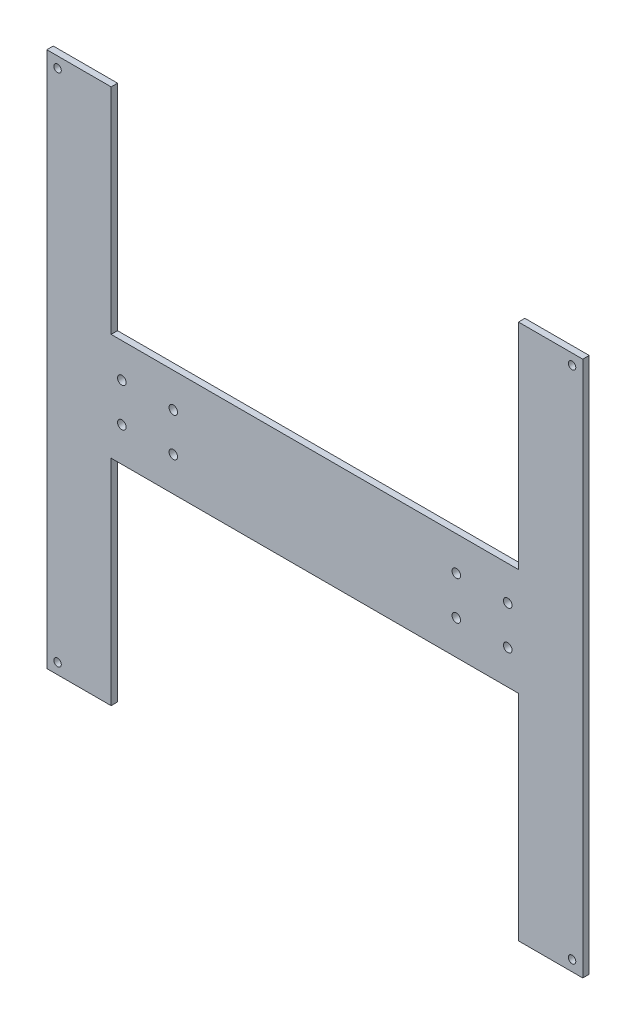
ISO-10303-21;
HEADER;
FILE_DESCRIPTION(('STEP AP214'),'2;1');
FILE_NAME('part.step','',(''),(''),'','','');
FILE_SCHEMA(('AUTOMOTIVE_DESIGN { 1 0 10303 214 1 1 1 1 }'));
ENDSEC;
DATA;
#1=APPLICATION_CONTEXT('core data for automotive mechanical design processes');
#2=APPLICATION_PROTOCOL_DEFINITION('international standard','automotive_design',2000,#1);
#3=PRODUCT_CONTEXT('',#1,'mechanical');
#4=PRODUCT('Part','Part','',(#3));
#5=PRODUCT_RELATED_PRODUCT_CATEGORY('part','',(#4));
#6=PRODUCT_DEFINITION_FORMATION('','',#4);
#7=PRODUCT_DEFINITION_CONTEXT('part definition',#1,'design');
#8=PRODUCT_DEFINITION('design','',#6,#7);
#9=PRODUCT_DEFINITION_SHAPE('','',#8);
#10=(LENGTH_UNIT() NAMED_UNIT(*) SI_UNIT(.MILLI.,.METRE.));
#11=(NAMED_UNIT(*) PLANE_ANGLE_UNIT() SI_UNIT($,.RADIAN.));
#12=(NAMED_UNIT(*) SI_UNIT($,.STERADIAN.) SOLID_ANGLE_UNIT());
#13=UNCERTAINTY_MEASURE_WITH_UNIT(LENGTH_MEASURE(1.E-05),#10,'distance_accuracy_value','');
#14=(GEOMETRIC_REPRESENTATION_CONTEXT(3) GLOBAL_UNCERTAINTY_ASSIGNED_CONTEXT((#13)) GLOBAL_UNIT_ASSIGNED_CONTEXT((#10,
#11,#12)) REPRESENTATION_CONTEXT('',''));
#15=CARTESIAN_POINT('',(0.,0.,0.));
#16=DIRECTION('',(0.,0.,1.));
#17=DIRECTION('',(1.,0.,0.));
#18=AXIS2_PLACEMENT_3D('',#15,#16,#17);
#19=CARTESIAN_POINT('',(0.,0.,3.));
#20=DIRECTION('',(0.,0.,-1.));
#21=DIRECTION('',(-1.,0.,0.));
#22=AXIS2_PLACEMENT_3D('',#19,#20,#21);
#23=PLANE('',#22);
#24=CARTESIAN_POINT('',(120.,-120.,3.));
#25=DIRECTION('',(0.,0.,1.));
#26=DIRECTION('',(1.,0.,0.));
#27=AXIS2_PLACEMENT_3D('',#24,#25,#26);
#28=CIRCLE('',#27,1.75);
#29=CARTESIAN_POINT('',(121.75,-120.,3.));
#30=VERTEX_POINT('',#29);
#31=EDGE_CURVE('E317',#30,#30,#28,.T.);
#32=ORIENTED_EDGE('',*,*,#31,.F.);
#33=EDGE_LOOP('',(#32));
#34=FACE_BOUND('',#33,.T.);
#35=CARTESIAN_POINT('',(-120.,-120.,3.));
#36=DIRECTION('',(0.,0.,1.));
#37=DIRECTION('',(1.,0.,0.));
#38=AXIS2_PLACEMENT_3D('',#35,#36,#37);
#39=CIRCLE('',#38,1.75);
#40=CARTESIAN_POINT('',(-118.25,-120.,3.));
#41=VERTEX_POINT('',#40);
#42=EDGE_CURVE('E319',#41,#41,#39,.T.);
#43=ORIENTED_EDGE('',*,*,#42,.F.);
#44=EDGE_LOOP('',(#43));
#45=FACE_BOUND('',#44,.T.);
#46=CARTESIAN_POINT('',(120.,120.,3.));
#47=DIRECTION('',(0.,0.,1.));
#48=DIRECTION('',(1.,0.,0.));
#49=AXIS2_PLACEMENT_3D('',#46,#47,#48);
#50=CIRCLE('',#49,1.75);
#51=CARTESIAN_POINT('',(121.75,120.,3.));
#52=VERTEX_POINT('',#51);
#53=EDGE_CURVE('E325',#52,#52,#50,.T.);
#54=ORIENTED_EDGE('',*,*,#53,.F.);
#55=EDGE_LOOP('',(#54));
#56=FACE_BOUND('',#55,.T.);
#57=CARTESIAN_POINT('',(-120.,120.,3.));
#58=DIRECTION('',(0.,0.,1.));
#59=DIRECTION('',(1.,0.,0.));
#60=AXIS2_PLACEMENT_3D('',#57,#58,#59);
#61=CIRCLE('',#60,1.75);
#62=CARTESIAN_POINT('',(-118.25,120.,3.));
#63=VERTEX_POINT('',#62);
#64=EDGE_CURVE('E331',#63,#63,#61,.T.);
#65=ORIENTED_EDGE('',*,*,#64,.F.);
#66=EDGE_LOOP('',(#65));
#67=FACE_BOUND('',#66,.T.);
#68=CARTESIAN_POINT('',(-90.,-9.,3.));
#69=DIRECTION('',(0.,0.,1.));
#70=DIRECTION('',(-1.,0.,0.));
#71=AXIS2_PLACEMENT_3D('',#68,#69,#70);
#72=CIRCLE('',#71,2.);
#73=CARTESIAN_POINT('',(-92.,-9.,3.));
#74=VERTEX_POINT('',#73);
#75=EDGE_CURVE('E346',#74,#74,#72,.T.);
#76=ORIENTED_EDGE('',*,*,#75,.F.);
#77=EDGE_LOOP('',(#76));
#78=FACE_BOUND('',#77,.T.);
#79=CARTESIAN_POINT('',(-66.,-9.,3.));
#80=DIRECTION('',(0.,0.,1.));
#81=DIRECTION('',(-1.,0.,0.));
#82=AXIS2_PLACEMENT_3D('',#79,#80,#81);
#83=CIRCLE('',#82,2.);
#84=CARTESIAN_POINT('',(-68.,-9.,3.));
#85=VERTEX_POINT('',#84);
#86=EDGE_CURVE('E358',#85,#85,#83,.T.);
#87=ORIENTED_EDGE('',*,*,#86,.F.);
#88=EDGE_LOOP('',(#87));
#89=FACE_BOUND('',#88,.T.);
#90=CARTESIAN_POINT('',(66.,9.,3.));
#91=DIRECTION('',(0.,0.,1.));
#92=DIRECTION('',(1.,0.,0.));
#93=AXIS2_PLACEMENT_3D('',#90,#91,#92);
#94=CIRCLE('',#93,2.);
#95=CARTESIAN_POINT('',(68.,9.,3.));
#96=VERTEX_POINT('',#95);
#97=EDGE_CURVE('E370',#96,#96,#94,.T.);
#98=ORIENTED_EDGE('',*,*,#97,.F.);
#99=EDGE_LOOP('',(#98));
#100=FACE_BOUND('',#99,.T.);
#101=CARTESIAN_POINT('',(90.,9.,3.));
#102=DIRECTION('',(0.,0.,1.));
#103=DIRECTION('',(1.,0.,0.));
#104=AXIS2_PLACEMENT_3D('',#101,#102,#103);
#105=CIRCLE('',#104,2.);
#106=CARTESIAN_POINT('',(92.,9.,3.));
#107=VERTEX_POINT('',#106);
#108=EDGE_CURVE('E158',#107,#107,#105,.T.);
#109=ORIENTED_EDGE('',*,*,#108,.F.);
#110=EDGE_LOOP('',(#109));
#111=FACE_BOUND('',#110,.T.);
#112=DIRECTION('',(1.,0.,0.));
#113=VECTOR('',#112,1.);
#114=CARTESIAN_POINT('',(95.,-125.,3.));
#115=LINE('',#114,#113);
#116=CARTESIAN_POINT('',(95.,-125.,3.));
#117=VERTEX_POINT('',#116);
#118=CARTESIAN_POINT('',(125.,-125.,3.));
#119=VERTEX_POINT('',#118);
#120=EDGE_CURVE('E177',#117,#119,#115,.T.);
#121=ORIENTED_EDGE('',*,*,#120,.T.);
#122=DIRECTION('',(0.,1.,0.));
#123=VECTOR('',#122,1.);
#124=CARTESIAN_POINT('',(125.,125.,3.));
#125=LINE('',#124,#123);
#126=CARTESIAN_POINT('',(125.,125.,3.));
#127=VERTEX_POINT('',#126);
#128=EDGE_CURVE('E105',#119,#127,#125,.T.);
#129=ORIENTED_EDGE('',*,*,#128,.T.);
#130=DIRECTION('',(-1.,0.,0.));
#131=VECTOR('',#130,1.);
#132=CARTESIAN_POINT('',(95.,125.,3.));
#133=LINE('',#132,#131);
#134=CARTESIAN_POINT('',(95.,125.,3.));
#135=VERTEX_POINT('',#134);
#136=EDGE_CURVE('E204',#127,#135,#133,.T.);
#137=ORIENTED_EDGE('',*,*,#136,.T.);
#138=DIRECTION('',(0.,-1.,0.));
#139=VECTOR('',#138,1.);
#140=CARTESIAN_POINT('',(95.,125.,3.));
#141=LINE('',#140,#139);
#142=CARTESIAN_POINT('',(95.,25.,3.));
#143=VERTEX_POINT('',#142);
#144=EDGE_CURVE('E223',#135,#143,#141,.T.);
#145=ORIENTED_EDGE('',*,*,#144,.T.);
#146=DIRECTION('',(-1.,0.,0.));
#147=VECTOR('',#146,1.);
#148=CARTESIAN_POINT('',(-95.,25.,3.));
#149=LINE('',#148,#147);
#150=CARTESIAN_POINT('',(-95.,25.,3.));
#151=VERTEX_POINT('',#150);
#152=EDGE_CURVE('E220',#143,#151,#149,.T.);
#153=ORIENTED_EDGE('',*,*,#152,.T.);
#154=DIRECTION('',(0.,1.,0.));
#155=VECTOR('',#154,1.);
#156=CARTESIAN_POINT('',(-95.,125.,3.));
#157=LINE('',#156,#155);
#158=CARTESIAN_POINT('',(-95.,125.,3.));
#159=VERTEX_POINT('',#158);
#160=EDGE_CURVE('E222',#151,#159,#157,.T.);
#161=ORIENTED_EDGE('',*,*,#160,.T.);
#162=DIRECTION('',(-1.,0.,0.));
#163=VECTOR('',#162,1.);
#164=CARTESIAN_POINT('',(-125.,125.,3.));
#165=LINE('',#164,#163);
#166=CARTESIAN_POINT('',(-125.,125.,3.));
#167=VERTEX_POINT('',#166);
#168=EDGE_CURVE('E225',#159,#167,#165,.T.);
#169=ORIENTED_EDGE('',*,*,#168,.T.);
#170=DIRECTION('',(0.,-1.,0.));
#171=VECTOR('',#170,1.);
#172=CARTESIAN_POINT('',(-125.,125.,3.));
#173=LINE('',#172,#171);
#174=CARTESIAN_POINT('',(-125.,-125.,3.));
#175=VERTEX_POINT('',#174);
#176=EDGE_CURVE('E231',#167,#175,#173,.T.);
#177=ORIENTED_EDGE('',*,*,#176,.T.);
#178=DIRECTION('',(1.,0.,0.));
#179=VECTOR('',#178,1.);
#180=CARTESIAN_POINT('',(-125.,-125.,3.));
#181=LINE('',#180,#179);
#182=CARTESIAN_POINT('',(-95.,-125.,3.));
#183=VERTEX_POINT('',#182);
#184=EDGE_CURVE('E136',#175,#183,#181,.T.);
#185=ORIENTED_EDGE('',*,*,#184,.T.);
#186=DIRECTION('',(0.,1.,0.));
#187=VECTOR('',#186,1.);
#188=CARTESIAN_POINT('',(-95.,-125.,3.));
#189=LINE('',#188,#187);
#190=CARTESIAN_POINT('',(-95.,-25.,3.));
#191=VERTEX_POINT('',#190);
#192=EDGE_CURVE('E130',#183,#191,#189,.T.);
#193=ORIENTED_EDGE('',*,*,#192,.T.);
#194=DIRECTION('',(1.,0.,0.));
#195=VECTOR('',#194,1.);
#196=CARTESIAN_POINT('',(-95.,-25.,3.));
#197=LINE('',#196,#195);
#198=CARTESIAN_POINT('',(95.,-25.,3.));
#199=VERTEX_POINT('',#198);
#200=EDGE_CURVE('E134',#191,#199,#197,.T.);
#201=ORIENTED_EDGE('',*,*,#200,.T.);
#202=DIRECTION('',(0.,-1.,0.));
#203=VECTOR('',#202,1.);
#204=CARTESIAN_POINT('',(95.,-125.,3.));
#205=LINE('',#204,#203);
#206=EDGE_CURVE('E50',#199,#117,#205,.T.);
#207=ORIENTED_EDGE('',*,*,#206,.T.);
#208=EDGE_LOOP('',(#121,#129,#137,#145,#153,#161,#169,#177,#185,#193,#201,#207));
#209=FACE_BOUND('',#208,.T.);
#210=CARTESIAN_POINT('',(90.,-9.,3.));
#211=DIRECTION('',(0.,0.,1.));
#212=DIRECTION('',(1.,0.,0.));
#213=AXIS2_PLACEMENT_3D('',#210,#211,#212);
#214=CIRCLE('',#213,2.);
#215=CARTESIAN_POINT('',(92.,-9.,3.));
#216=VERTEX_POINT('',#215);
#217=EDGE_CURVE('E376',#216,#216,#214,.T.);
#218=ORIENTED_EDGE('',*,*,#217,.F.);
#219=EDGE_LOOP('',(#218));
#220=FACE_BOUND('',#219,.T.);
#221=CARTESIAN_POINT('',(66.,-9.,3.));
#222=DIRECTION('',(0.,0.,1.));
#223=DIRECTION('',(1.,0.,0.));
#224=AXIS2_PLACEMENT_3D('',#221,#222,#223);
#225=CIRCLE('',#224,2.);
#226=CARTESIAN_POINT('',(68.,-9.,3.));
#227=VERTEX_POINT('',#226);
#228=EDGE_CURVE('E364',#227,#227,#225,.T.);
#229=ORIENTED_EDGE('',*,*,#228,.F.);
#230=EDGE_LOOP('',(#229));
#231=FACE_BOUND('',#230,.T.);
#232=CARTESIAN_POINT('',(-66.,9.,3.));
#233=DIRECTION('',(0.,0.,1.));
#234=DIRECTION('',(-1.,0.,0.));
#235=AXIS2_PLACEMENT_3D('',#232,#233,#234);
#236=CIRCLE('',#235,2.);
#237=CARTESIAN_POINT('',(-68.,9.,3.));
#238=VERTEX_POINT('',#237);
#239=EDGE_CURVE('E352',#238,#238,#236,.T.);
#240=ORIENTED_EDGE('',*,*,#239,.F.);
#241=EDGE_LOOP('',(#240));
#242=FACE_BOUND('',#241,.T.);
#243=CARTESIAN_POINT('',(-90.,9.,3.));
#244=DIRECTION('',(0.,0.,1.));
#245=DIRECTION('',(-1.,0.,0.));
#246=AXIS2_PLACEMENT_3D('',#243,#244,#245);
#247=CIRCLE('',#246,2.);
#248=CARTESIAN_POINT('',(-92.,9.,3.));
#249=VERTEX_POINT('',#248);
#250=EDGE_CURVE('E340',#249,#249,#247,.T.);
#251=ORIENTED_EDGE('',*,*,#250,.F.);
#252=EDGE_LOOP('',(#251));
#253=FACE_BOUND('',#252,.T.);
#254=ADVANCED_FACE('F33',(#34,#45,#56,#67,#78,#89,#100,#111,#209,#220,#231,#242,#253),#23,.F.);
#255=CARTESIAN_POINT('',(0.,0.,0.));
#256=DIRECTION('',(0.,0.,-1.));
#257=DIRECTION('',(-1.,0.,0.));
#258=AXIS2_PLACEMENT_3D('',#255,#256,#257);
#259=PLANE('',#258);
#260=CARTESIAN_POINT('',(120.,-120.,0.));
#261=DIRECTION('',(0.,0.,1.));
#262=DIRECTION('',(1.,0.,0.));
#263=AXIS2_PLACEMENT_3D('',#260,#261,#262);
#264=CIRCLE('',#263,1.75);
#265=CARTESIAN_POINT('',(121.75,-120.,0.));
#266=VERTEX_POINT('',#265);
#267=EDGE_CURVE('E315',#266,#266,#264,.T.);
#268=ORIENTED_EDGE('',*,*,#267,.T.);
#269=EDGE_LOOP('',(#268));
#270=FACE_BOUND('',#269,.T.);
#271=CARTESIAN_POINT('',(-120.,-120.,0.));
#272=DIRECTION('',(0.,0.,1.));
#273=DIRECTION('',(1.,0.,0.));
#274=AXIS2_PLACEMENT_3D('',#271,#272,#273);
#275=CIRCLE('',#274,1.75);
#276=CARTESIAN_POINT('',(-118.25,-120.,0.));
#277=VERTEX_POINT('',#276);
#278=EDGE_CURVE('E322',#277,#277,#275,.T.);
#279=ORIENTED_EDGE('',*,*,#278,.T.);
#280=EDGE_LOOP('',(#279));
#281=FACE_BOUND('',#280,.T.);
#282=CARTESIAN_POINT('',(120.,120.,0.));
#283=DIRECTION('',(0.,0.,1.));
#284=DIRECTION('',(1.,0.,0.));
#285=AXIS2_PLACEMENT_3D('',#282,#283,#284);
#286=CIRCLE('',#285,1.75);
#287=CARTESIAN_POINT('',(121.75,120.,0.));
#288=VERTEX_POINT('',#287);
#289=EDGE_CURVE('E328',#288,#288,#286,.T.);
#290=ORIENTED_EDGE('',*,*,#289,.T.);
#291=EDGE_LOOP('',(#290));
#292=FACE_BOUND('',#291,.T.);
#293=CARTESIAN_POINT('',(-120.,120.,0.));
#294=DIRECTION('',(0.,0.,1.));
#295=DIRECTION('',(1.,0.,0.));
#296=AXIS2_PLACEMENT_3D('',#293,#294,#295);
#297=CIRCLE('',#296,1.75);
#298=CARTESIAN_POINT('',(-118.25,120.,0.));
#299=VERTEX_POINT('',#298);
#300=EDGE_CURVE('E334',#299,#299,#297,.T.);
#301=ORIENTED_EDGE('',*,*,#300,.T.);
#302=EDGE_LOOP('',(#301));
#303=FACE_BOUND('',#302,.T.);
#304=CARTESIAN_POINT('',(-90.,-9.,0.));
#305=DIRECTION('',(0.,0.,1.));
#306=DIRECTION('',(-1.,0.,0.));
#307=AXIS2_PLACEMENT_3D('',#304,#305,#306);
#308=CIRCLE('',#307,2.);
#309=CARTESIAN_POINT('',(-92.,-9.,0.));
#310=VERTEX_POINT('',#309);
#311=EDGE_CURVE('E343',#310,#310,#308,.T.);
#312=ORIENTED_EDGE('',*,*,#311,.T.);
#313=EDGE_LOOP('',(#312));
#314=FACE_BOUND('',#313,.T.);
#315=CARTESIAN_POINT('',(-66.,-9.,0.));
#316=DIRECTION('',(0.,0.,1.));
#317=DIRECTION('',(-1.,0.,0.));
#318=AXIS2_PLACEMENT_3D('',#315,#316,#317);
#319=CIRCLE('',#318,2.);
#320=CARTESIAN_POINT('',(-68.,-9.,0.));
#321=VERTEX_POINT('',#320);
#322=EDGE_CURVE('E355',#321,#321,#319,.T.);
#323=ORIENTED_EDGE('',*,*,#322,.T.);
#324=EDGE_LOOP('',(#323));
#325=FACE_BOUND('',#324,.T.);
#326=CARTESIAN_POINT('',(66.,9.,0.));
#327=DIRECTION('',(0.,0.,1.));
#328=DIRECTION('',(1.,0.,0.));
#329=AXIS2_PLACEMENT_3D('',#326,#327,#328);
#330=CIRCLE('',#329,2.);
#331=CARTESIAN_POINT('',(68.,9.,0.));
#332=VERTEX_POINT('',#331);
#333=EDGE_CURVE('E367',#332,#332,#330,.T.);
#334=ORIENTED_EDGE('',*,*,#333,.T.);
#335=EDGE_LOOP('',(#334));
#336=FACE_BOUND('',#335,.T.);
#337=CARTESIAN_POINT('',(90.,9.,0.));
#338=DIRECTION('',(0.,0.,1.));
#339=DIRECTION('',(1.,0.,0.));
#340=AXIS2_PLACEMENT_3D('',#337,#338,#339);
#341=CIRCLE('',#340,2.);
#342=CARTESIAN_POINT('',(92.,9.,0.));
#343=VERTEX_POINT('',#342);
#344=EDGE_CURVE('E379',#343,#343,#341,.T.);
#345=ORIENTED_EDGE('',*,*,#344,.T.);
#346=EDGE_LOOP('',(#345));
#347=FACE_BOUND('',#346,.T.);
#348=DIRECTION('',(1.,0.,0.));
#349=VECTOR('',#348,1.);
#350=CARTESIAN_POINT('',(95.,-125.,0.));
#351=LINE('',#350,#349);
#352=CARTESIAN_POINT('',(95.,-125.,0.));
#353=VERTEX_POINT('',#352);
#354=CARTESIAN_POINT('',(125.,-125.,0.));
#355=VERTEX_POINT('',#354);
#356=EDGE_CURVE('E154',#353,#355,#351,.T.);
#357=ORIENTED_EDGE('',*,*,#356,.F.);
#358=DIRECTION('',(0.,-1.,0.));
#359=VECTOR('',#358,1.);
#360=CARTESIAN_POINT('',(95.,-125.,0.));
#361=LINE('',#360,#359);
#362=CARTESIAN_POINT('',(95.,-25.,0.));
#363=VERTEX_POINT('',#362);
#364=EDGE_CURVE('E97',#363,#353,#361,.T.);
#365=ORIENTED_EDGE('',*,*,#364,.F.);
#366=DIRECTION('',(1.,0.,0.));
#367=VECTOR('',#366,1.);
#368=CARTESIAN_POINT('',(-95.,-25.,0.));
#369=LINE('',#368,#367);
#370=CARTESIAN_POINT('',(-95.,-25.,0.));
#371=VERTEX_POINT('',#370);
#372=EDGE_CURVE('E91',#371,#363,#369,.T.);
#373=ORIENTED_EDGE('',*,*,#372,.F.);
#374=DIRECTION('',(0.,1.,0.));
#375=VECTOR('',#374,1.);
#376=CARTESIAN_POINT('',(-95.,-125.,0.));
#377=LINE('',#376,#375);
#378=CARTESIAN_POINT('',(-95.,-125.,0.));
#379=VERTEX_POINT('',#378);
#380=EDGE_CURVE('E144',#379,#371,#377,.T.);
#381=ORIENTED_EDGE('',*,*,#380,.F.);
#382=DIRECTION('',(1.,0.,0.));
#383=VECTOR('',#382,1.);
#384=CARTESIAN_POINT('',(-125.,-125.,0.));
#385=LINE('',#384,#383);
#386=CARTESIAN_POINT('',(-125.,-125.,0.));
#387=VERTEX_POINT('',#386);
#388=EDGE_CURVE('E172',#387,#379,#385,.T.);
#389=ORIENTED_EDGE('',*,*,#388,.F.);
#390=DIRECTION('',(0.,-1.,0.));
#391=VECTOR('',#390,1.);
#392=CARTESIAN_POINT('',(-125.,125.,0.));
#393=LINE('',#392,#391);
#394=CARTESIAN_POINT('',(-125.,125.,0.));
#395=VERTEX_POINT('',#394);
#396=EDGE_CURVE('E170',#395,#387,#393,.T.);
#397=ORIENTED_EDGE('',*,*,#396,.F.);
#398=DIRECTION('',(-1.,0.,0.));
#399=VECTOR('',#398,1.);
#400=CARTESIAN_POINT('',(-125.,125.,0.));
#401=LINE('',#400,#399);
#402=CARTESIAN_POINT('',(-95.,125.,0.));
#403=VERTEX_POINT('',#402);
#404=EDGE_CURVE('E168',#403,#395,#401,.T.);
#405=ORIENTED_EDGE('',*,*,#404,.F.);
#406=DIRECTION('',(0.,1.,0.));
#407=VECTOR('',#406,1.);
#408=CARTESIAN_POINT('',(-95.,125.,0.));
#409=LINE('',#408,#407);
#410=CARTESIAN_POINT('',(-95.,25.,0.));
#411=VERTEX_POINT('',#410);
#412=EDGE_CURVE('E166',#411,#403,#409,.T.);
#413=ORIENTED_EDGE('',*,*,#412,.F.);
#414=DIRECTION('',(-1.,0.,0.));
#415=VECTOR('',#414,1.);
#416=CARTESIAN_POINT('',(-95.,25.,0.));
#417=LINE('',#416,#415);
#418=CARTESIAN_POINT('',(95.,25.,0.));
#419=VERTEX_POINT('',#418);
#420=EDGE_CURVE('E164',#419,#411,#417,.T.);
#421=ORIENTED_EDGE('',*,*,#420,.F.);
#422=DIRECTION('',(0.,-1.,0.));
#423=VECTOR('',#422,1.);
#424=CARTESIAN_POINT('',(95.,125.,0.));
#425=LINE('',#424,#423);
#426=CARTESIAN_POINT('',(95.,125.,0.));
#427=VERTEX_POINT('',#426);
#428=EDGE_CURVE('E162',#427,#419,#425,.T.);
#429=ORIENTED_EDGE('',*,*,#428,.F.);
#430=DIRECTION('',(-1.,0.,0.));
#431=VECTOR('',#430,1.);
#432=CARTESIAN_POINT('',(95.,125.,0.));
#433=LINE('',#432,#431);
#434=CARTESIAN_POINT('',(125.,125.,0.));
#435=VERTEX_POINT('',#434);
#436=EDGE_CURVE('E160',#435,#427,#433,.T.);
#437=ORIENTED_EDGE('',*,*,#436,.F.);
#438=DIRECTION('',(0.,1.,0.));
#439=VECTOR('',#438,1.);
#440=CARTESIAN_POINT('',(125.,125.,0.));
#441=LINE('',#440,#439);
#442=EDGE_CURVE('E157',#355,#435,#441,.T.);
#443=ORIENTED_EDGE('',*,*,#442,.F.);
#444=EDGE_LOOP('',(#357,#365,#373,#381,#389,#397,#405,#413,#421,#429,#437,#443));
#445=FACE_BOUND('',#444,.T.);
#446=CARTESIAN_POINT('',(90.,-9.,0.));
#447=DIRECTION('',(0.,0.,1.));
#448=DIRECTION('',(1.,0.,0.));
#449=AXIS2_PLACEMENT_3D('',#446,#447,#448);
#450=CIRCLE('',#449,2.);
#451=CARTESIAN_POINT('',(92.,-9.,0.));
#452=VERTEX_POINT('',#451);
#453=EDGE_CURVE('E373',#452,#452,#450,.T.);
#454=ORIENTED_EDGE('',*,*,#453,.T.);
#455=EDGE_LOOP('',(#454));
#456=FACE_BOUND('',#455,.T.);
#457=CARTESIAN_POINT('',(66.,-9.,0.));
#458=DIRECTION('',(0.,0.,1.));
#459=DIRECTION('',(1.,0.,0.));
#460=AXIS2_PLACEMENT_3D('',#457,#458,#459);
#461=CIRCLE('',#460,2.);
#462=CARTESIAN_POINT('',(68.,-9.,0.));
#463=VERTEX_POINT('',#462);
#464=EDGE_CURVE('E361',#463,#463,#461,.T.);
#465=ORIENTED_EDGE('',*,*,#464,.T.);
#466=EDGE_LOOP('',(#465));
#467=FACE_BOUND('',#466,.T.);
#468=CARTESIAN_POINT('',(-66.,9.,0.));
#469=DIRECTION('',(0.,0.,1.));
#470=DIRECTION('',(-1.,0.,0.));
#471=AXIS2_PLACEMENT_3D('',#468,#469,#470);
#472=CIRCLE('',#471,2.);
#473=CARTESIAN_POINT('',(-68.,9.,0.));
#474=VERTEX_POINT('',#473);
#475=EDGE_CURVE('E349',#474,#474,#472,.T.);
#476=ORIENTED_EDGE('',*,*,#475,.T.);
#477=EDGE_LOOP('',(#476));
#478=FACE_BOUND('',#477,.T.);
#479=CARTESIAN_POINT('',(-90.,9.,0.));
#480=DIRECTION('',(0.,0.,1.));
#481=DIRECTION('',(-1.,0.,0.));
#482=AXIS2_PLACEMENT_3D('',#479,#480,#481);
#483=CIRCLE('',#482,2.);
#484=CARTESIAN_POINT('',(-92.,9.,0.));
#485=VERTEX_POINT('',#484);
#486=EDGE_CURVE('E337',#485,#485,#483,.T.);
#487=ORIENTED_EDGE('',*,*,#486,.T.);
#488=EDGE_LOOP('',(#487));
#489=FACE_BOUND('',#488,.T.);
#490=ADVANCED_FACE('F208',(#270,#281,#292,#303,#314,#325,#336,#347,#445,#456,#467,#478,#489),
#259,.T.);
#491=CARTESIAN_POINT('',(95.,-125.,3.));
#492=DIRECTION('',(0.,1.,0.));
#493=DIRECTION('',(0.,0.,1.));
#494=AXIS2_PLACEMENT_3D('',#491,#492,#493);
#495=PLANE('',#494);
#496=ORIENTED_EDGE('',*,*,#356,.T.);
#497=DIRECTION('',(0.,0.,-1.));
#498=VECTOR('',#497,1.);
#499=CARTESIAN_POINT('',(125.,-125.,3.));
#500=LINE('',#499,#498);
#501=EDGE_CURVE('E11',#119,#355,#500,.T.);
#502=ORIENTED_EDGE('',*,*,#501,.F.);
#503=ORIENTED_EDGE('',*,*,#120,.F.);
#504=DIRECTION('',(0.,0.,-1.));
#505=VECTOR('',#504,1.);
#506=CARTESIAN_POINT('',(95.,-125.,3.));
#507=LINE('',#506,#505);
#508=EDGE_CURVE('E150',#117,#353,#507,.T.);
#509=ORIENTED_EDGE('',*,*,#508,.T.);
#510=EDGE_LOOP('',(#496,#502,#503,#509));
#511=FACE_BOUND('',#510,.T.);
#512=ADVANCED_FACE('F35',(#511),#495,.F.);
#513=CARTESIAN_POINT('',(125.,125.,3.));
#514=DIRECTION('',(-1.,0.,0.));
#515=DIRECTION('',(0.,-1.,0.));
#516=AXIS2_PLACEMENT_3D('',#513,#514,#515);
#517=PLANE('',#516);
#518=ORIENTED_EDGE('',*,*,#442,.T.);
#519=DIRECTION('',(0.,0.,-1.));
#520=VECTOR('',#519,1.);
#521=CARTESIAN_POINT('',(125.,125.,3.));
#522=LINE('',#521,#520);
#523=EDGE_CURVE('E42',#127,#435,#522,.T.);
#524=ORIENTED_EDGE('',*,*,#523,.F.);
#525=ORIENTED_EDGE('',*,*,#128,.F.);
#526=ORIENTED_EDGE('',*,*,#501,.T.);
#527=EDGE_LOOP('',(#518,#524,#525,#526));
#528=FACE_BOUND('',#527,.T.);
#529=ADVANCED_FACE('F563',(#528),#517,.F.);
#530=CARTESIAN_POINT('',(95.,125.,3.));
#531=DIRECTION('',(0.,-1.,0.));
#532=DIRECTION('',(0.,0.,-1.));
#533=AXIS2_PLACEMENT_3D('',#530,#531,#532);
#534=PLANE('',#533);
#535=ORIENTED_EDGE('',*,*,#436,.T.);
#536=DIRECTION('',(0.,0.,-1.));
#537=VECTOR('',#536,1.);
#538=CARTESIAN_POINT('',(95.,125.,3.));
#539=LINE('',#538,#537);
#540=EDGE_CURVE('E196',#135,#427,#539,.T.);
#541=ORIENTED_EDGE('',*,*,#540,.F.);
#542=ORIENTED_EDGE('',*,*,#136,.F.);
#543=ORIENTED_EDGE('',*,*,#523,.T.);
#544=EDGE_LOOP('',(#535,#541,#542,#543));
#545=FACE_BOUND('',#544,.T.);
#546=ADVANCED_FACE('F202',(#545),#534,.F.);
#547=CARTESIAN_POINT('',(95.,125.,3.));
#548=DIRECTION('',(1.,0.,0.));
#549=DIRECTION('',(0.,1.,0.));
#550=AXIS2_PLACEMENT_3D('',#547,#548,#549);
#551=PLANE('',#550);
#552=ORIENTED_EDGE('',*,*,#428,.T.);
#553=DIRECTION('',(0.,0.,-1.));
#554=VECTOR('',#553,1.);
#555=CARTESIAN_POINT('',(95.,25.,3.));
#556=LINE('',#555,#554);
#557=EDGE_CURVE('E193',#143,#419,#556,.T.);
#558=ORIENTED_EDGE('',*,*,#557,.F.);
#559=ORIENTED_EDGE('',*,*,#144,.F.);
#560=ORIENTED_EDGE('',*,*,#540,.T.);
#561=EDGE_LOOP('',(#552,#558,#559,#560));
#562=FACE_BOUND('',#561,.T.);
#563=ADVANCED_FACE('F214',(#562),#551,.F.);
#564=CARTESIAN_POINT('',(-95.,25.,3.));
#565=DIRECTION('',(0.,-1.,0.));
#566=DIRECTION('',(1.,0.,0.));
#567=AXIS2_PLACEMENT_3D('',#564,#565,#566);
#568=PLANE('',#567);
#569=ORIENTED_EDGE('',*,*,#420,.T.);
#570=DIRECTION('',(0.,0.,-1.));
#571=VECTOR('',#570,1.);
#572=CARTESIAN_POINT('',(-95.,25.,3.));
#573=LINE('',#572,#571);
#574=EDGE_CURVE('E190',#151,#411,#573,.T.);
#575=ORIENTED_EDGE('',*,*,#574,.F.);
#576=ORIENTED_EDGE('',*,*,#152,.F.);
#577=ORIENTED_EDGE('',*,*,#557,.T.);
#578=EDGE_LOOP('',(#569,#575,#576,#577));
#579=FACE_BOUND('',#578,.T.);
#580=ADVANCED_FACE('F218',(#579),#568,.F.);
#581=CARTESIAN_POINT('',(-95.,125.,3.));
#582=DIRECTION('',(-1.,0.,0.));
#583=DIRECTION('',(0.,-1.,0.));
#584=AXIS2_PLACEMENT_3D('',#581,#582,#583);
#585=PLANE('',#584);
#586=ORIENTED_EDGE('',*,*,#412,.T.);
#587=DIRECTION('',(0.,0.,-1.));
#588=VECTOR('',#587,1.);
#589=CARTESIAN_POINT('',(-95.,125.,3.));
#590=LINE('',#589,#588);
#591=EDGE_CURVE('E187',#159,#403,#590,.T.);
#592=ORIENTED_EDGE('',*,*,#591,.F.);
#593=ORIENTED_EDGE('',*,*,#160,.F.);
#594=ORIENTED_EDGE('',*,*,#574,.T.);
#595=EDGE_LOOP('',(#586,#592,#593,#594));
#596=FACE_BOUND('',#595,.T.);
#597=ADVANCED_FACE('F528',(#596),#585,.F.);
#598=CARTESIAN_POINT('',(-125.,125.,3.));
#599=DIRECTION('',(0.,-1.,0.));
#600=DIRECTION('',(0.,0.,-1.));
#601=AXIS2_PLACEMENT_3D('',#598,#599,#600);
#602=PLANE('',#601);
#603=ORIENTED_EDGE('',*,*,#404,.T.);
#604=DIRECTION('',(0.,0.,-1.));
#605=VECTOR('',#604,1.);
#606=CARTESIAN_POINT('',(-125.,125.,3.));
#607=LINE('',#606,#605);
#608=EDGE_CURVE('E184',#167,#395,#607,.T.);
#609=ORIENTED_EDGE('',*,*,#608,.F.);
#610=ORIENTED_EDGE('',*,*,#168,.F.);
#611=ORIENTED_EDGE('',*,*,#591,.T.);
#612=EDGE_LOOP('',(#603,#609,#610,#611));
#613=FACE_BOUND('',#612,.T.);
#614=ADVANCED_FACE('F519',(#613),#602,.F.);
#615=CARTESIAN_POINT('',(-125.,125.,3.));
#616=DIRECTION('',(1.,0.,0.));
#617=DIRECTION('',(0.,1.,0.));
#618=AXIS2_PLACEMENT_3D('',#615,#616,#617);
#619=PLANE('',#618);
#620=ORIENTED_EDGE('',*,*,#396,.T.);
#621=DIRECTION('',(0.,0.,-1.));
#622=VECTOR('',#621,1.);
#623=CARTESIAN_POINT('',(-125.,-125.,3.));
#624=LINE('',#623,#622);
#625=EDGE_CURVE('E181',#175,#387,#624,.T.);
#626=ORIENTED_EDGE('',*,*,#625,.F.);
#627=ORIENTED_EDGE('',*,*,#176,.F.);
#628=ORIENTED_EDGE('',*,*,#608,.T.);
#629=EDGE_LOOP('',(#620,#626,#627,#628));
#630=FACE_BOUND('',#629,.T.);
#631=ADVANCED_FACE('F237',(#630),#619,.F.);
#632=CARTESIAN_POINT('',(-125.,-125.,3.));
#633=DIRECTION('',(0.,1.,0.));
#634=DIRECTION('',(0.,0.,1.));
#635=AXIS2_PLACEMENT_3D('',#632,#633,#634);
#636=PLANE('',#635);
#637=ORIENTED_EDGE('',*,*,#388,.T.);
#638=DIRECTION('',(0.,0.,-1.));
#639=VECTOR('',#638,1.);
#640=CARTESIAN_POINT('',(-95.,-125.,3.));
#641=LINE('',#640,#639);
#642=EDGE_CURVE('E145',#183,#379,#641,.T.);
#643=ORIENTED_EDGE('',*,*,#642,.F.);
#644=ORIENTED_EDGE('',*,*,#184,.F.);
#645=ORIENTED_EDGE('',*,*,#625,.T.);
#646=EDGE_LOOP('',(#637,#643,#644,#645));
#647=FACE_BOUND('',#646,.T.);
#648=ADVANCED_FACE('F241',(#647),#636,.F.);
#649=CARTESIAN_POINT('',(-95.,-125.,3.));
#650=DIRECTION('',(-1.,0.,0.));
#651=DIRECTION('',(0.,-1.,0.));
#652=AXIS2_PLACEMENT_3D('',#649,#650,#651);
#653=PLANE('',#652);
#654=ORIENTED_EDGE('',*,*,#380,.T.);
#655=DIRECTION('',(0.,0.,-1.));
#656=VECTOR('',#655,1.);
#657=CARTESIAN_POINT('',(-95.,-25.,3.));
#658=LINE('',#657,#656);
#659=EDGE_CURVE('E141',#191,#371,#658,.T.);
#660=ORIENTED_EDGE('',*,*,#659,.F.);
#661=ORIENTED_EDGE('',*,*,#192,.F.);
#662=ORIENTED_EDGE('',*,*,#642,.T.);
#663=EDGE_LOOP('',(#654,#660,#661,#662));
#664=FACE_BOUND('',#663,.T.);
#665=ADVANCED_FACE('F142',(#664),#653,.F.);
#666=CARTESIAN_POINT('',(-95.,-25.,3.));
#667=DIRECTION('',(0.,1.,0.));
#668=DIRECTION('',(-1.,0.,0.));
#669=AXIS2_PLACEMENT_3D('',#666,#667,#668);
#670=PLANE('',#669);
#671=ORIENTED_EDGE('',*,*,#372,.T.);
#672=DIRECTION('',(0.,0.,-1.));
#673=VECTOR('',#672,1.);
#674=CARTESIAN_POINT('',(95.,-25.,3.));
#675=LINE('',#674,#673);
#676=EDGE_CURVE('E146',#199,#363,#675,.T.);
#677=ORIENTED_EDGE('',*,*,#676,.F.);
#678=ORIENTED_EDGE('',*,*,#200,.F.);
#679=ORIENTED_EDGE('',*,*,#659,.T.);
#680=EDGE_LOOP('',(#671,#677,#678,#679));
#681=FACE_BOUND('',#680,.T.);
#682=ADVANCED_FACE('F148',(#681),#670,.F.);
#683=CARTESIAN_POINT('',(95.,-125.,3.));
#684=DIRECTION('',(1.,0.,0.));
#685=DIRECTION('',(0.,1.,0.));
#686=AXIS2_PLACEMENT_3D('',#683,#684,#685);
#687=PLANE('',#686);
#688=ORIENTED_EDGE('',*,*,#364,.T.);
#689=ORIENTED_EDGE('',*,*,#508,.F.);
#690=ORIENTED_EDGE('',*,*,#206,.F.);
#691=ORIENTED_EDGE('',*,*,#676,.T.);
#692=EDGE_LOOP('',(#688,#689,#690,#691));
#693=FACE_BOUND('',#692,.T.);
#694=ADVANCED_FACE('F245',(#693),#687,.F.);
#695=CARTESIAN_POINT('',(90.,9.,3.));
#696=DIRECTION('',(0.,0.,-1.));
#697=DIRECTION('',(-1.,0.,0.));
#698=AXIS2_PLACEMENT_3D('',#695,#696,#697);
#699=CYLINDRICAL_SURFACE('',#698,2.);
#700=ORIENTED_EDGE('',*,*,#108,.T.);
#701=EDGE_LOOP('',(#700));
#702=FACE_BOUND('',#701,.T.);
#703=ORIENTED_EDGE('',*,*,#344,.F.);
#704=EDGE_LOOP('',(#703));
#705=FACE_BOUND('',#704,.T.);
#706=ADVANCED_FACE('F247',(#702,#705),#699,.F.);
#707=CARTESIAN_POINT('',(90.,-9.,3.));
#708=DIRECTION('',(0.,0.,-1.));
#709=DIRECTION('',(-1.,0.,0.));
#710=AXIS2_PLACEMENT_3D('',#707,#708,#709);
#711=CYLINDRICAL_SURFACE('',#710,2.);
#712=ORIENTED_EDGE('',*,*,#217,.T.);
#713=EDGE_LOOP('',(#712));
#714=FACE_BOUND('',#713,.T.);
#715=ORIENTED_EDGE('',*,*,#453,.F.);
#716=EDGE_LOOP('',(#715));
#717=FACE_BOUND('',#716,.T.);
#718=ADVANCED_FACE('F253',(#714,#717),#711,.F.);
#719=CARTESIAN_POINT('',(66.,9.,3.));
#720=DIRECTION('',(0.,0.,-1.));
#721=DIRECTION('',(-1.,0.,0.));
#722=AXIS2_PLACEMENT_3D('',#719,#720,#721);
#723=CYLINDRICAL_SURFACE('',#722,2.);
#724=ORIENTED_EDGE('',*,*,#97,.T.);
#725=EDGE_LOOP('',(#724));
#726=FACE_BOUND('',#725,.T.);
#727=ORIENTED_EDGE('',*,*,#333,.F.);
#728=EDGE_LOOP('',(#727));
#729=FACE_BOUND('',#728,.T.);
#730=ADVANCED_FACE('F270',(#726,#729),#723,.F.);
#731=CARTESIAN_POINT('',(66.,-9.,3.));
#732=DIRECTION('',(0.,0.,-1.));
#733=DIRECTION('',(-1.,0.,0.));
#734=AXIS2_PLACEMENT_3D('',#731,#732,#733);
#735=CYLINDRICAL_SURFACE('',#734,2.);
#736=ORIENTED_EDGE('',*,*,#228,.T.);
#737=EDGE_LOOP('',(#736));
#738=FACE_BOUND('',#737,.T.);
#739=ORIENTED_EDGE('',*,*,#464,.F.);
#740=EDGE_LOOP('',(#739));
#741=FACE_BOUND('',#740,.T.);
#742=ADVANCED_FACE('F274',(#738,#741),#735,.F.);
#743=CARTESIAN_POINT('',(-66.,-9.,3.));
#744=DIRECTION('',(0.,0.,-1.));
#745=DIRECTION('',(-1.,0.,0.));
#746=AXIS2_PLACEMENT_3D('',#743,#744,#745);
#747=CYLINDRICAL_SURFACE('',#746,2.);
#748=ORIENTED_EDGE('',*,*,#86,.T.);
#749=EDGE_LOOP('',(#748));
#750=FACE_BOUND('',#749,.T.);
#751=ORIENTED_EDGE('',*,*,#322,.F.);
#752=EDGE_LOOP('',(#751));
#753=FACE_BOUND('',#752,.T.);
#754=ADVANCED_FACE('F278',(#750,#753),#747,.F.);
#755=CARTESIAN_POINT('',(-66.,9.,3.));
#756=DIRECTION('',(0.,0.,-1.));
#757=DIRECTION('',(-1.,0.,0.));
#758=AXIS2_PLACEMENT_3D('',#755,#756,#757);
#759=CYLINDRICAL_SURFACE('',#758,2.);
#760=ORIENTED_EDGE('',*,*,#239,.T.);
#761=EDGE_LOOP('',(#760));
#762=FACE_BOUND('',#761,.T.);
#763=ORIENTED_EDGE('',*,*,#475,.F.);
#764=EDGE_LOOP('',(#763));
#765=FACE_BOUND('',#764,.T.);
#766=ADVANCED_FACE('F282',(#762,#765),#759,.F.);
#767=CARTESIAN_POINT('',(-90.,-9.,3.));
#768=DIRECTION('',(0.,0.,-1.));
#769=DIRECTION('',(-1.,0.,0.));
#770=AXIS2_PLACEMENT_3D('',#767,#768,#769);
#771=CYLINDRICAL_SURFACE('',#770,2.);
#772=ORIENTED_EDGE('',*,*,#75,.T.);
#773=EDGE_LOOP('',(#772));
#774=FACE_BOUND('',#773,.T.);
#775=ORIENTED_EDGE('',*,*,#311,.F.);
#776=EDGE_LOOP('',(#775));
#777=FACE_BOUND('',#776,.T.);
#778=ADVANCED_FACE('F286',(#774,#777),#771,.F.);
#779=CARTESIAN_POINT('',(-90.,9.,3.));
#780=DIRECTION('',(0.,0.,-1.));
#781=DIRECTION('',(-1.,0.,0.));
#782=AXIS2_PLACEMENT_3D('',#779,#780,#781);
#783=CYLINDRICAL_SURFACE('',#782,2.);
#784=ORIENTED_EDGE('',*,*,#250,.T.);
#785=EDGE_LOOP('',(#784));
#786=FACE_BOUND('',#785,.T.);
#787=ORIENTED_EDGE('',*,*,#486,.F.);
#788=EDGE_LOOP('',(#787));
#789=FACE_BOUND('',#788,.T.);
#790=ADVANCED_FACE('F290',(#786,#789),#783,.F.);
#791=CARTESIAN_POINT('',(-120.,120.,0.));
#792=DIRECTION('',(0.,0.,1.));
#793=DIRECTION('',(1.,0.,0.));
#794=AXIS2_PLACEMENT_3D('',#791,#792,#793);
#795=CYLINDRICAL_SURFACE('',#794,1.75);
#796=ORIENTED_EDGE('',*,*,#300,.F.);
#797=EDGE_LOOP('',(#796));
#798=FACE_BOUND('',#797,.T.);
#799=ORIENTED_EDGE('',*,*,#64,.T.);
#800=EDGE_LOOP('',(#799));
#801=FACE_BOUND('',#800,.T.);
#802=ADVANCED_FACE('F294',(#798,#801),#795,.F.);
#803=CARTESIAN_POINT('',(120.,120.,0.));
#804=DIRECTION('',(0.,0.,1.));
#805=DIRECTION('',(1.,0.,0.));
#806=AXIS2_PLACEMENT_3D('',#803,#804,#805);
#807=CYLINDRICAL_SURFACE('',#806,1.75);
#808=ORIENTED_EDGE('',*,*,#289,.F.);
#809=EDGE_LOOP('',(#808));
#810=FACE_BOUND('',#809,.T.);
#811=ORIENTED_EDGE('',*,*,#53,.T.);
#812=EDGE_LOOP('',(#811));
#813=FACE_BOUND('',#812,.T.);
#814=ADVANCED_FACE('F298',(#810,#813),#807,.F.);
#815=CARTESIAN_POINT('',(-120.,-120.,0.));
#816=DIRECTION('',(0.,0.,1.));
#817=DIRECTION('',(1.,0.,0.));
#818=AXIS2_PLACEMENT_3D('',#815,#816,#817);
#819=CYLINDRICAL_SURFACE('',#818,1.75);
#820=ORIENTED_EDGE('',*,*,#278,.F.);
#821=EDGE_LOOP('',(#820));
#822=FACE_BOUND('',#821,.T.);
#823=ORIENTED_EDGE('',*,*,#42,.T.);
#824=EDGE_LOOP('',(#823));
#825=FACE_BOUND('',#824,.T.);
#826=ADVANCED_FACE('F302',(#822,#825),#819,.F.);
#827=CARTESIAN_POINT('',(120.,-120.,0.));
#828=DIRECTION('',(0.,0.,1.));
#829=DIRECTION('',(1.,0.,0.));
#830=AXIS2_PLACEMENT_3D('',#827,#828,#829);
#831=CYLINDRICAL_SURFACE('',#830,1.75);
#832=ORIENTED_EDGE('',*,*,#267,.F.);
#833=EDGE_LOOP('',(#832));
#834=FACE_BOUND('',#833,.T.);
#835=ORIENTED_EDGE('',*,*,#31,.T.);
#836=EDGE_LOOP('',(#835));
#837=FACE_BOUND('',#836,.T.);
#838=ADVANCED_FACE('F306',(#834,#837),#831,.F.);
#839=CLOSED_SHELL('',(#254,#490,#512,#529,#546,#563,#580,#597,#614,#631,#648,#665,#682,#694,
#706,#718,#730,#742,#754,#766,#778,#790,#802,#814,#826,#838));
#840=MANIFOLD_SOLID_BREP('B2',#839);
#841=ADVANCED_BREP_SHAPE_REPRESENTATION('',(#18,#840),#14);
#842=SHAPE_DEFINITION_REPRESENTATION(#9,#841);
ENDSEC;
END-ISO-10303-21;
